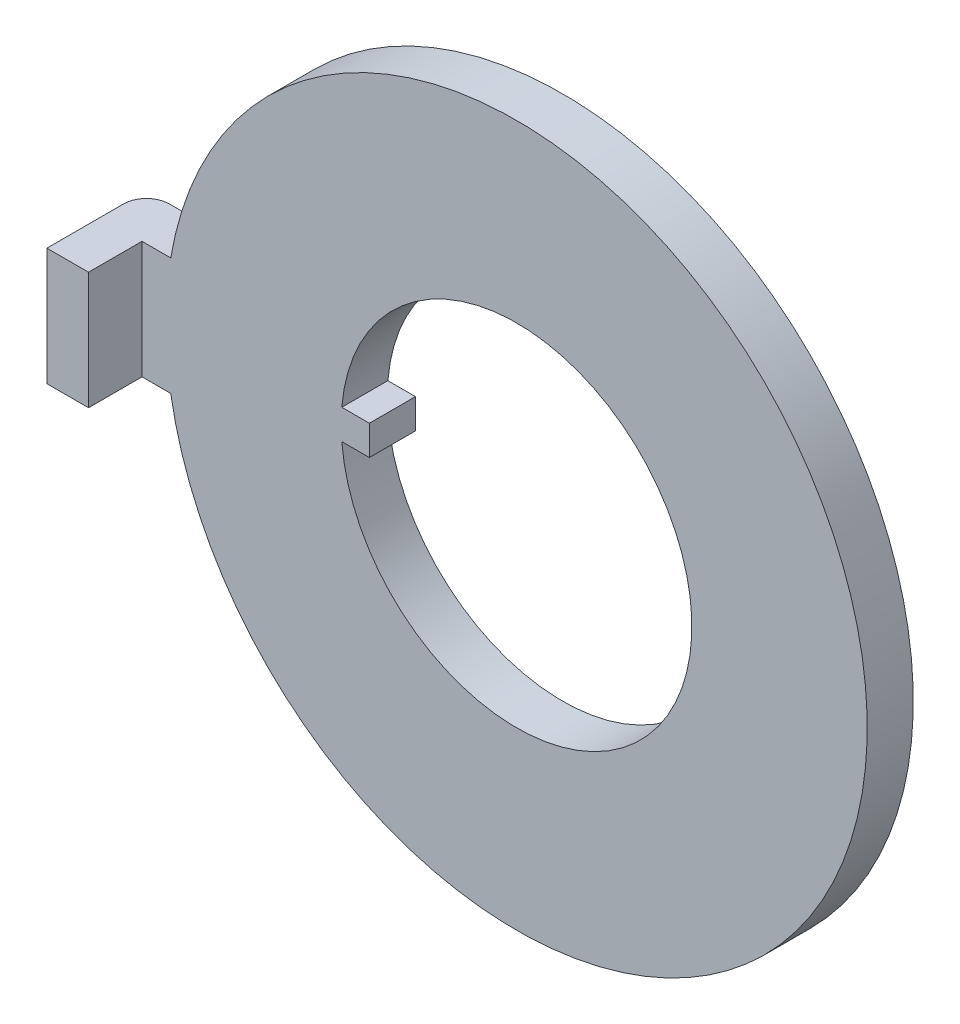
ISO-10303-21;
HEADER;
FILE_DESCRIPTION(('STEP AP214'),'2;1');
FILE_NAME('part.step','',(''),(''),'','','');
FILE_SCHEMA(('AUTOMOTIVE_DESIGN { 1 0 10303 214 1 1 1 1 }'));
ENDSEC;
DATA;
#1=APPLICATION_CONTEXT('core data for automotive mechanical design processes');
#2=APPLICATION_PROTOCOL_DEFINITION('international standard','automotive_design',2000,#1);
#3=PRODUCT_CONTEXT('',#1,'mechanical');
#4=PRODUCT('Part','Part','',(#3));
#5=PRODUCT_RELATED_PRODUCT_CATEGORY('part','',(#4));
#6=PRODUCT_DEFINITION_FORMATION('','',#4);
#7=PRODUCT_DEFINITION_CONTEXT('part definition',#1,'design');
#8=PRODUCT_DEFINITION('design','',#6,#7);
#9=PRODUCT_DEFINITION_SHAPE('','',#8);
#10=(LENGTH_UNIT() NAMED_UNIT(*) SI_UNIT(.MILLI.,.METRE.));
#11=(NAMED_UNIT(*) PLANE_ANGLE_UNIT() SI_UNIT($,.RADIAN.));
#12=(NAMED_UNIT(*) SI_UNIT($,.STERADIAN.) SOLID_ANGLE_UNIT());
#13=UNCERTAINTY_MEASURE_WITH_UNIT(LENGTH_MEASURE(1.E-05),#10,'distance_accuracy_value','');
#14=(GEOMETRIC_REPRESENTATION_CONTEXT(3) GLOBAL_UNCERTAINTY_ASSIGNED_CONTEXT((#13)) GLOBAL_UNIT_ASSIGNED_CONTEXT((#10,
#11,#12)) REPRESENTATION_CONTEXT('',''));
#15=CARTESIAN_POINT('',(0.,0.,0.));
#16=DIRECTION('',(0.,0.,1.));
#17=DIRECTION('',(1.,0.,0.));
#18=AXIS2_PLACEMENT_3D('',#15,#16,#17);
#19=CARTESIAN_POINT('',(-2.98641789440129,0.254,0.7874));
#20=DIRECTION('',(0.,1.,0.));
#21=DIRECTION('',(0.,0.,1.));
#22=AXIS2_PLACEMENT_3D('',#19,#20,#21);
#23=PLANE('',#22);
#24=DIRECTION('',(1.,0.,0.));
#25=VECTOR('',#24,1.);
#26=CARTESIAN_POINT('',(-2.98641789440129,0.254,0.));
#27=LINE('',#26,#25);
#28=CARTESIAN_POINT('',(-2.98641789440129,0.254000000000003,0.));
#29=VERTEX_POINT('',#28);
#30=CARTESIAN_POINT('',(-2.5146,0.254,0.));
#31=VERTEX_POINT('',#30);
#32=EDGE_CURVE('E11',#29,#31,#27,.T.);
#33=ORIENTED_EDGE('',*,*,#32,.F.);
#34=DIRECTION('',(0.,0.,-1.));
#35=VECTOR('',#34,1.);
#36=CARTESIAN_POINT('',(-2.98641789440129,0.254000000000003,0.7874));
#37=LINE('',#36,#35);
#38=CARTESIAN_POINT('',(-2.98641789440129,0.254000000000003,0.7874));
#39=VERTEX_POINT('',#38);
#40=EDGE_CURVE('E25',#39,#29,#37,.T.);
#41=ORIENTED_EDGE('',*,*,#40,.F.);
#42=DIRECTION('',(1.,0.,0.));
#43=VECTOR('',#42,1.);
#44=CARTESIAN_POINT('',(-2.98641789440129,0.254,0.7874));
#45=LINE('',#44,#43);
#46=CARTESIAN_POINT('',(-2.5146,0.254,0.7874));
#47=VERTEX_POINT('',#46);
#48=EDGE_CURVE('E242',#39,#47,#45,.T.);
#49=ORIENTED_EDGE('',*,*,#48,.T.);
#50=DIRECTION('',(0.,0.,-1.));
#51=VECTOR('',#50,1.);
#52=CARTESIAN_POINT('',(-2.5146,0.254,0.7874));
#53=LINE('',#52,#51);
#54=EDGE_CURVE('E238',#47,#31,#53,.T.);
#55=ORIENTED_EDGE('',*,*,#54,.T.);
#56=EDGE_LOOP('',(#33,#41,#49,#55));
#57=FACE_BOUND('',#56,.T.);
#58=ADVANCED_FACE('F17',(#57),#23,.T.);
#59=CARTESIAN_POINT('',(-2.5146,0.254,0.7874));
#60=DIRECTION('',(1.,0.,0.));
#61=DIRECTION('',(0.,0.,-1.));
#62=AXIS2_PLACEMENT_3D('',#59,#60,#61);
#63=PLANE('',#62);
#64=DIRECTION('',(0.,-1.,0.));
#65=VECTOR('',#64,1.);
#66=CARTESIAN_POINT('',(-2.5146,0.254,0.));
#67=LINE('',#66,#65);
#68=CARTESIAN_POINT('',(-2.5146,-0.254,0.));
#69=VERTEX_POINT('',#68);
#70=EDGE_CURVE('E233',#31,#69,#67,.T.);
#71=ORIENTED_EDGE('',*,*,#70,.F.);
#72=ORIENTED_EDGE('',*,*,#54,.F.);
#73=DIRECTION('',(0.,-1.,0.));
#74=VECTOR('',#73,1.);
#75=CARTESIAN_POINT('',(-2.5146,0.254,0.7874));
#76=LINE('',#75,#74);
#77=CARTESIAN_POINT('',(-2.5146,-0.254,0.7874));
#78=VERTEX_POINT('',#77);
#79=EDGE_CURVE('E229',#47,#78,#76,.T.);
#80=ORIENTED_EDGE('',*,*,#79,.T.);
#81=DIRECTION('',(0.,0.,-1.));
#82=VECTOR('',#81,1.);
#83=CARTESIAN_POINT('',(-2.5146,-0.254,0.7874));
#84=LINE('',#83,#82);
#85=EDGE_CURVE('E225',#78,#69,#84,.T.);
#86=ORIENTED_EDGE('',*,*,#85,.T.);
#87=EDGE_LOOP('',(#71,#72,#80,#86));
#88=FACE_BOUND('',#87,.T.);
#89=ADVANCED_FACE('F269',(#88),#63,.T.);
#90=CARTESIAN_POINT('',(-2.5146,-0.254,0.7874));
#91=DIRECTION('',(0.,-1.,0.));
#92=DIRECTION('',(0.,0.,-1.));
#93=AXIS2_PLACEMENT_3D('',#90,#91,#92);
#94=PLANE('',#93);
#95=DIRECTION('',(-1.,0.,0.));
#96=VECTOR('',#95,1.);
#97=CARTESIAN_POINT('',(-2.5146,-0.254,0.));
#98=LINE('',#97,#96);
#99=CARTESIAN_POINT('',(-2.98641789440129,-0.254000000000003,0.));
#100=VERTEX_POINT('',#99);
#101=EDGE_CURVE('E220',#69,#100,#98,.T.);
#102=ORIENTED_EDGE('',*,*,#101,.F.);
#103=ORIENTED_EDGE('',*,*,#85,.F.);
#104=DIRECTION('',(-1.,0.,0.));
#105=VECTOR('',#104,1.);
#106=CARTESIAN_POINT('',(-2.5146,-0.254,0.7874));
#107=LINE('',#106,#105);
#108=CARTESIAN_POINT('',(-2.98641789440129,-0.254000000000003,0.7874));
#109=VERTEX_POINT('',#108);
#110=EDGE_CURVE('E216',#78,#109,#107,.T.);
#111=ORIENTED_EDGE('',*,*,#110,.T.);
#112=DIRECTION('',(0.,0.,-1.));
#113=VECTOR('',#112,1.);
#114=CARTESIAN_POINT('',(-2.98641789440129,-0.254000000000003,0.7874));
#115=LINE('',#114,#113);
#116=EDGE_CURVE('E212',#109,#100,#115,.T.);
#117=ORIENTED_EDGE('',*,*,#116,.T.);
#118=EDGE_LOOP('',(#102,#103,#111,#117));
#119=FACE_BOUND('',#118,.T.);
#120=ADVANCED_FACE('F262',(#119),#94,.T.);
#121=CARTESIAN_POINT('',(0.,0.,0.7874));
#122=DIRECTION('',(0.,0.,1.));
#123=DIRECTION('',(-1.,0.,0.));
#124=AXIS2_PLACEMENT_3D('',#121,#122,#123);
#125=CYLINDRICAL_SURFACE('',#124,2.99720000000003);
#126=ORIENTED_EDGE('',*,*,#40,.T.);
#127=CARTESIAN_POINT('',(0.,0.,0.));
#128=DIRECTION('',(0.,0.,1.));
#129=DIRECTION('',(1.,0.,0.));
#130=AXIS2_PLACEMENT_3D('',#127,#128,#129);
#131=CIRCLE('',#130,2.99720000000003);
#132=EDGE_CURVE('E207',#100,#29,#131,.T.);
#133=ORIENTED_EDGE('',*,*,#132,.F.);
#134=ORIENTED_EDGE('',*,*,#116,.F.);
#135=CARTESIAN_POINT('',(0.,0.,0.7874));
#136=DIRECTION('',(0.,0.,1.));
#137=DIRECTION('',(1.,0.,0.));
#138=AXIS2_PLACEMENT_3D('',#135,#136,#137);
#139=CIRCLE('',#138,2.99720000000003);
#140=EDGE_CURVE('E203',#109,#39,#139,.T.);
#141=ORIENTED_EDGE('',*,*,#140,.T.);
#142=EDGE_LOOP('',(#126,#133,#134,#141));
#143=FACE_BOUND('',#142,.T.);
#144=ADVANCED_FACE('F252',(#143),#125,.F.);
#145=CARTESIAN_POINT('',(0.,0.,0.7874));
#146=DIRECTION('',(0.,0.,1.));
#147=DIRECTION('',(1.,0.,0.));
#148=AXIS2_PLACEMENT_3D('',#145,#146,#147);
#149=PLANE('',#148);
#150=CARTESIAN_POINT('',(0.,0.,0.7874));
#151=DIRECTION('',(0.,0.,1.));
#152=DIRECTION('',(1.,0.,0.));
#153=AXIS2_PLACEMENT_3D('',#150,#151,#152);
#154=CIRCLE('',#153,5.9944);
#155=CARTESIAN_POINT('',(-5.90984098517041,-1.0033,0.7874));
#156=VERTEX_POINT('',#155);
#157=CARTESIAN_POINT('',(-5.90984098517041,1.0033,0.7874));
#158=VERTEX_POINT('',#157);
#159=EDGE_CURVE('E199',#156,#158,#154,.T.);
#160=ORIENTED_EDGE('',*,*,#159,.T.);
#161=DIRECTION('',(1.,0.,0.));
#162=VECTOR('',#161,1.);
#163=CARTESIAN_POINT('',(-6.4008,1.0033,0.7874));
#164=LINE('',#163,#162);
#165=CARTESIAN_POINT('',(-6.4008,1.0033,0.7874));
#166=VERTEX_POINT('',#165);
#167=EDGE_CURVE('E195',#166,#158,#164,.T.);
#168=ORIENTED_EDGE('',*,*,#167,.F.);
#169=DIRECTION('',(0.,-1.,0.));
#170=VECTOR('',#169,1.);
#171=CARTESIAN_POINT('',(-6.4008,1.0033,0.7874));
#172=LINE('',#171,#170);
#173=CARTESIAN_POINT('',(-6.4008,-1.0033,0.7874));
#174=VERTEX_POINT('',#173);
#175=EDGE_CURVE('E116',#166,#174,#172,.T.);
#176=ORIENTED_EDGE('',*,*,#175,.T.);
#177=DIRECTION('',(1.,0.,0.));
#178=VECTOR('',#177,1.);
#179=CARTESIAN_POINT('',(-6.4008,-1.0033,0.7874));
#180=LINE('',#179,#178);
#181=EDGE_CURVE('E188',#174,#156,#180,.T.);
#182=ORIENTED_EDGE('',*,*,#181,.T.);
#183=EDGE_LOOP('',(#160,#168,#176,#182));
#184=FACE_BOUND('',#183,.T.);
#185=ORIENTED_EDGE('',*,*,#110,.F.);
#186=ORIENTED_EDGE('',*,*,#79,.F.);
#187=ORIENTED_EDGE('',*,*,#48,.F.);
#188=ORIENTED_EDGE('',*,*,#140,.F.);
#189=EDGE_LOOP('',(#185,#186,#187,#188));
#190=FACE_BOUND('',#189,.T.);
#191=ADVANCED_FACE('F265',(#184,#190),#149,.T.);
#192=CARTESIAN_POINT('',(-6.71829999999992,-1.0033,0.393700000000081));
#193=DIRECTION('',(0.,1.,0.));
#194=DIRECTION('',(0.,0.,1.));
#195=AXIS2_PLACEMENT_3D('',#192,#193,#194);
#196=PLANE('',#195);
#197=DIRECTION('',(-1.,0.,0.));
#198=VECTOR('',#197,1.);
#199=CARTESIAN_POINT('',(-4.4958,-1.0033,0.));
#200=LINE('',#199,#198);
#201=CARTESIAN_POINT('',(-5.90984098517041,-1.0033,0.));
#202=VERTEX_POINT('',#201);
#203=CARTESIAN_POINT('',(-6.7183,-1.0033,0.));
#204=VERTEX_POINT('',#203);
#205=EDGE_CURVE('E183',#202,#204,#200,.T.);
#206=ORIENTED_EDGE('',*,*,#205,.F.);
#207=DIRECTION('',(0.,0.,-1.));
#208=VECTOR('',#207,1.);
#209=CARTESIAN_POINT('',(-5.90984098517041,-1.0033,0.7874));
#210=LINE('',#209,#208);
#211=EDGE_CURVE('E178',#156,#202,#210,.T.);
#212=ORIENTED_EDGE('',*,*,#211,.F.);
#213=ORIENTED_EDGE('',*,*,#181,.F.);
#214=DIRECTION('',(0.,0.,-1.));
#215=VECTOR('',#214,1.);
#216=CARTESIAN_POINT('',(-6.4008,-1.0033,1.7018));
#217=LINE('',#216,#215);
#218=CARTESIAN_POINT('',(-6.4008,-1.0033,1.7018));
#219=VERTEX_POINT('',#218);
#220=EDGE_CURVE('E174',#219,#174,#217,.T.);
#221=ORIENTED_EDGE('',*,*,#220,.F.);
#222=DIRECTION('',(1.,0.,0.));
#223=VECTOR('',#222,1.);
#224=CARTESIAN_POINT('',(-7.112,-1.0033,1.7018));
#225=LINE('',#224,#223);
#226=CARTESIAN_POINT('',(-7.112,-1.0033,1.7018));
#227=VERTEX_POINT('',#226);
#228=EDGE_CURVE('E119',#227,#219,#225,.T.);
#229=ORIENTED_EDGE('',*,*,#228,.F.);
#230=DIRECTION('',(0.,0.,1.));
#231=VECTOR('',#230,1.);
#232=CARTESIAN_POINT('',(-7.112,-1.0033,0.3937));
#233=LINE('',#232,#231);
#234=CARTESIAN_POINT('',(-7.112,-1.0033,0.3937));
#235=VERTEX_POINT('',#234);
#236=EDGE_CURVE('E166',#235,#227,#233,.T.);
#237=ORIENTED_EDGE('',*,*,#236,.F.);
#238=CARTESIAN_POINT('',(-6.71829999999992,-1.0033,0.393700000000081));
#239=DIRECTION('',(0.,1.,0.));
#240=DIRECTION('',(1.,0.,0.));
#241=AXIS2_PLACEMENT_3D('',#238,#239,#240);
#242=CIRCLE('',#241,0.393700000000081);
#243=EDGE_CURVE('E161',#204,#235,#242,.T.);
#244=ORIENTED_EDGE('',*,*,#243,.F.);
#245=EDGE_LOOP('',(#206,#212,#213,#221,#229,#237,#244));
#246=FACE_BOUND('',#245,.T.);
#247=ADVANCED_FACE('F282',(#246),#196,.F.);
#248=CARTESIAN_POINT('',(-6.71829999999992,1.0033,0.393700000000081));
#249=DIRECTION('',(0.,1.,0.));
#250=DIRECTION('',(0.707106781186475,0.,0.70710678118662));
#251=AXIS2_PLACEMENT_3D('',#248,#249,#250);
#252=CYLINDRICAL_SURFACE('',#251,0.393700000000081);
#253=ORIENTED_EDGE('',*,*,#243,.T.);
#254=DIRECTION('',(0.,-1.,0.));
#255=VECTOR('',#254,1.);
#256=CARTESIAN_POINT('',(-7.112,1.0033,0.3937));
#257=LINE('',#256,#255);
#258=CARTESIAN_POINT('',(-7.112,1.0033,0.3937));
#259=VERTEX_POINT('',#258);
#260=EDGE_CURVE('E156',#259,#235,#257,.T.);
#261=ORIENTED_EDGE('',*,*,#260,.F.);
#262=CARTESIAN_POINT('',(-6.71829999999992,1.0033,0.393700000000081));
#263=DIRECTION('',(0.,1.,0.));
#264=DIRECTION('',(1.,0.,0.));
#265=AXIS2_PLACEMENT_3D('',#262,#263,#264);
#266=CIRCLE('',#265,0.393700000000081);
#267=CARTESIAN_POINT('',(-6.7183,1.0033,0.));
#268=VERTEX_POINT('',#267);
#269=EDGE_CURVE('E152',#268,#259,#266,.T.);
#270=ORIENTED_EDGE('',*,*,#269,.F.);
#271=DIRECTION('',(0.,-1.,0.));
#272=VECTOR('',#271,1.);
#273=CARTESIAN_POINT('',(-6.7183,1.0033,0.));
#274=LINE('',#273,#272);
#275=EDGE_CURVE('E147',#268,#204,#274,.T.);
#276=ORIENTED_EDGE('',*,*,#275,.T.);
#277=EDGE_LOOP('',(#253,#261,#270,#276));
#278=FACE_BOUND('',#277,.T.);
#279=ADVANCED_FACE('F286',(#278),#252,.T.);
#280=CARTESIAN_POINT('',(0.,0.,0.));
#281=DIRECTION('',(0.,0.,1.));
#282=DIRECTION('',(1.,0.,0.));
#283=AXIS2_PLACEMENT_3D('',#280,#281,#282);
#284=PLANE('',#283);
#285=CARTESIAN_POINT('',(0.,0.,0.));
#286=DIRECTION('',(0.,0.,1.));
#287=DIRECTION('',(1.,0.,0.));
#288=AXIS2_PLACEMENT_3D('',#285,#286,#287);
#289=CIRCLE('',#288,5.9944);
#290=CARTESIAN_POINT('',(-5.90984098517041,1.0033,0.));
#291=VERTEX_POINT('',#290);
#292=EDGE_CURVE('E142',#202,#291,#289,.T.);
#293=ORIENTED_EDGE('',*,*,#292,.F.);
#294=ORIENTED_EDGE('',*,*,#205,.T.);
#295=ORIENTED_EDGE('',*,*,#275,.F.);
#296=DIRECTION('',(-1.,0.,0.));
#297=VECTOR('',#296,1.);
#298=CARTESIAN_POINT('',(-4.4958,1.0033,0.));
#299=LINE('',#298,#297);
#300=EDGE_CURVE('E137',#291,#268,#299,.T.);
#301=ORIENTED_EDGE('',*,*,#300,.F.);
#302=EDGE_LOOP('',(#293,#294,#295,#301));
#303=FACE_BOUND('',#302,.T.);
#304=ORIENTED_EDGE('',*,*,#101,.T.);
#305=ORIENTED_EDGE('',*,*,#132,.T.);
#306=ORIENTED_EDGE('',*,*,#32,.T.);
#307=ORIENTED_EDGE('',*,*,#70,.T.);
#308=EDGE_LOOP('',(#304,#305,#306,#307));
#309=FACE_BOUND('',#308,.T.);
#310=ADVANCED_FACE('F257',(#303,#309),#284,.F.);
#311=CARTESIAN_POINT('',(-6.71829999999992,1.0033,0.393700000000081));
#312=DIRECTION('',(0.,1.,0.));
#313=DIRECTION('',(0.,0.,1.));
#314=AXIS2_PLACEMENT_3D('',#311,#312,#313);
#315=PLANE('',#314);
#316=DIRECTION('',(0.,0.,-1.));
#317=VECTOR('',#316,1.);
#318=CARTESIAN_POINT('',(-5.90984098517041,1.0033,0.7874));
#319=LINE('',#318,#317);
#320=EDGE_CURVE('E133',#158,#291,#319,.T.);
#321=ORIENTED_EDGE('',*,*,#320,.T.);
#322=ORIENTED_EDGE('',*,*,#300,.T.);
#323=ORIENTED_EDGE('',*,*,#269,.T.);
#324=DIRECTION('',(0.,0.,1.));
#325=VECTOR('',#324,1.);
#326=CARTESIAN_POINT('',(-7.112,1.0033,0.3937));
#327=LINE('',#326,#325);
#328=CARTESIAN_POINT('',(-7.112,1.0033,1.7018));
#329=VERTEX_POINT('',#328);
#330=EDGE_CURVE('E104',#259,#329,#327,.T.);
#331=ORIENTED_EDGE('',*,*,#330,.T.);
#332=DIRECTION('',(1.,0.,0.));
#333=VECTOR('',#332,1.);
#334=CARTESIAN_POINT('',(-7.112,1.0033,1.7018));
#335=LINE('',#334,#333);
#336=CARTESIAN_POINT('',(-6.4008,1.0033,1.7018));
#337=VERTEX_POINT('',#336);
#338=EDGE_CURVE('E95',#329,#337,#335,.T.);
#339=ORIENTED_EDGE('',*,*,#338,.T.);
#340=DIRECTION('',(0.,0.,-1.));
#341=VECTOR('',#340,1.);
#342=CARTESIAN_POINT('',(-6.4008,1.0033,1.7018));
#343=LINE('',#342,#341);
#344=EDGE_CURVE('E100',#337,#166,#343,.T.);
#345=ORIENTED_EDGE('',*,*,#344,.T.);
#346=ORIENTED_EDGE('',*,*,#167,.T.);
#347=EDGE_LOOP('',(#321,#322,#323,#331,#339,#345,#346));
#348=FACE_BOUND('',#347,.T.);
#349=ADVANCED_FACE('F98',(#348),#315,.T.);
#350=CARTESIAN_POINT('',(-6.4008,1.0033,1.7018));
#351=DIRECTION('',(-1.,0.,0.));
#352=DIRECTION('',(0.,0.,1.));
#353=AXIS2_PLACEMENT_3D('',#350,#351,#352);
#354=PLANE('',#353);
#355=ORIENTED_EDGE('',*,*,#220,.T.);
#356=ORIENTED_EDGE('',*,*,#175,.F.);
#357=ORIENTED_EDGE('',*,*,#344,.F.);
#358=DIRECTION('',(0.,-1.,0.));
#359=VECTOR('',#358,1.);
#360=CARTESIAN_POINT('',(-6.4008,1.0033,1.7018));
#361=LINE('',#360,#359);
#362=EDGE_CURVE('E114',#337,#219,#361,.T.);
#363=ORIENTED_EDGE('',*,*,#362,.T.);
#364=EDGE_LOOP('',(#355,#356,#357,#363));
#365=FACE_BOUND('',#364,.T.);
#366=ADVANCED_FACE('F113',(#365),#354,.F.);
#367=CARTESIAN_POINT('',(-7.112,1.0033,1.7018));
#368=DIRECTION('',(0.,0.,-1.));
#369=DIRECTION('',(-1.,0.,0.));
#370=AXIS2_PLACEMENT_3D('',#367,#368,#369);
#371=PLANE('',#370);
#372=ORIENTED_EDGE('',*,*,#228,.T.);
#373=ORIENTED_EDGE('',*,*,#362,.F.);
#374=ORIENTED_EDGE('',*,*,#338,.F.);
#375=DIRECTION('',(0.,-1.,0.));
#376=VECTOR('',#375,1.);
#377=CARTESIAN_POINT('',(-7.112,1.0033,1.7018));
#378=LINE('',#377,#376);
#379=EDGE_CURVE('E120',#329,#227,#378,.T.);
#380=ORIENTED_EDGE('',*,*,#379,.T.);
#381=EDGE_LOOP('',(#372,#373,#374,#380));
#382=FACE_BOUND('',#381,.T.);
#383=ADVANCED_FACE('F118',(#382),#371,.F.);
#384=CARTESIAN_POINT('',(-7.112,1.0033,0.3937));
#385=DIRECTION('',(1.,0.,0.));
#386=DIRECTION('',(0.,0.,-1.));
#387=AXIS2_PLACEMENT_3D('',#384,#385,#386);
#388=PLANE('',#387);
#389=ORIENTED_EDGE('',*,*,#236,.T.);
#390=ORIENTED_EDGE('',*,*,#379,.F.);
#391=ORIENTED_EDGE('',*,*,#330,.F.);
#392=ORIENTED_EDGE('',*,*,#260,.T.);
#393=EDGE_LOOP('',(#389,#390,#391,#392));
#394=FACE_BOUND('',#393,.T.);
#395=ADVANCED_FACE('F300',(#394),#388,.F.);
#396=CARTESIAN_POINT('',(0.,0.,0.7874));
#397=DIRECTION('',(0.,0.,1.));
#398=DIRECTION('',(-1.,0.,0.));
#399=AXIS2_PLACEMENT_3D('',#396,#397,#398);
#400=CYLINDRICAL_SURFACE('',#399,5.9944);
#401=ORIENTED_EDGE('',*,*,#292,.T.);
#402=ORIENTED_EDGE('',*,*,#320,.F.);
#403=ORIENTED_EDGE('',*,*,#159,.F.);
#404=ORIENTED_EDGE('',*,*,#211,.T.);
#405=EDGE_LOOP('',(#401,#402,#403,#404));
#406=FACE_BOUND('',#405,.T.);
#407=ADVANCED_FACE('F303',(#406),#400,.T.);
#408=CLOSED_SHELL('',(#58,#89,#120,#144,#191,#247,#279,#310,#349,#366,#383,#395,#407));
#409=MANIFOLD_SOLID_BREP('B1',#408);
#410=ADVANCED_BREP_SHAPE_REPRESENTATION('',(#18,#409),#14);
#411=SHAPE_DEFINITION_REPRESENTATION(#9,#410);
ENDSEC;
END-ISO-10303-21;
